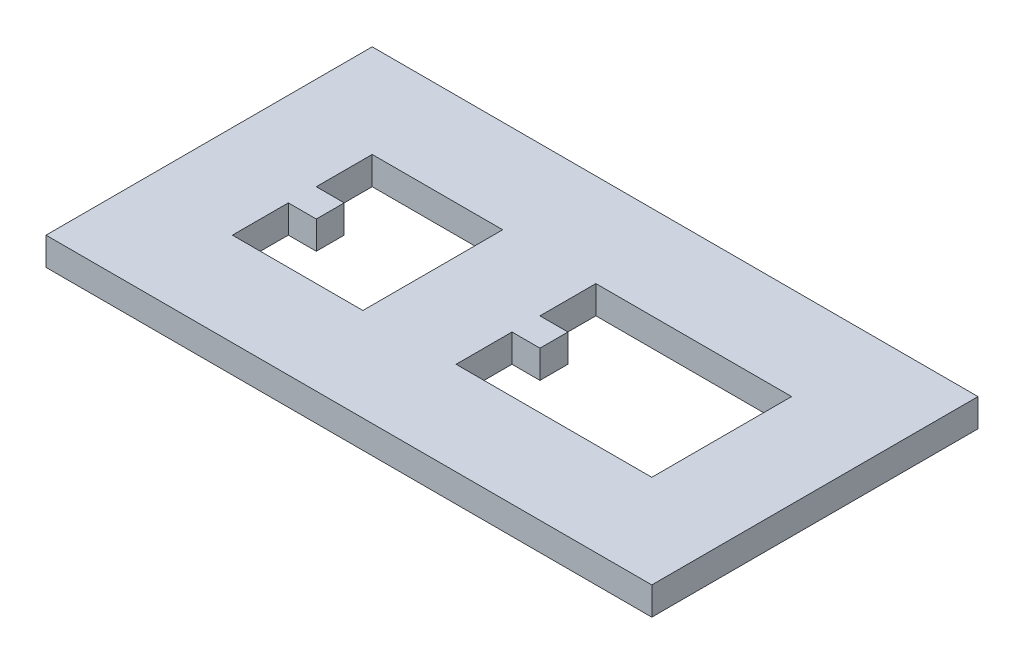
ISO-10303-21;
HEADER;
FILE_DESCRIPTION(('STEP AP214'),'2;1');
FILE_NAME('part.step','',(''),(''),'','','');
FILE_SCHEMA(('AUTOMOTIVE_DESIGN { 1 0 10303 214 1 1 1 1 }'));
ENDSEC;
DATA;
#1=APPLICATION_CONTEXT('core data for automotive mechanical design processes');
#2=APPLICATION_PROTOCOL_DEFINITION('international standard','automotive_design',2000,#1);
#3=PRODUCT_CONTEXT('',#1,'mechanical');
#4=PRODUCT('Part','Part','',(#3));
#5=PRODUCT_RELATED_PRODUCT_CATEGORY('part','',(#4));
#6=PRODUCT_DEFINITION_FORMATION('','',#4);
#7=PRODUCT_DEFINITION_CONTEXT('part definition',#1,'design');
#8=PRODUCT_DEFINITION('design','',#6,#7);
#9=PRODUCT_DEFINITION_SHAPE('','',#8);
#10=(LENGTH_UNIT() NAMED_UNIT(*) SI_UNIT(.MILLI.,.METRE.));
#11=(NAMED_UNIT(*) PLANE_ANGLE_UNIT() SI_UNIT($,.RADIAN.));
#12=(NAMED_UNIT(*) SI_UNIT($,.STERADIAN.) SOLID_ANGLE_UNIT());
#13=UNCERTAINTY_MEASURE_WITH_UNIT(LENGTH_MEASURE(1.E-05),#10,'distance_accuracy_value','');
#14=(GEOMETRIC_REPRESENTATION_CONTEXT(3) GLOBAL_UNCERTAINTY_ASSIGNED_CONTEXT((#13)) GLOBAL_UNIT_ASSIGNED_CONTEXT((#10,
#11,#12)) REPRESENTATION_CONTEXT('',''));
#15=CARTESIAN_POINT('',(0.,0.,0.));
#16=DIRECTION('',(0.,0.,1.));
#17=DIRECTION('',(1.,0.,0.));
#18=AXIS2_PLACEMENT_3D('',#15,#16,#17);
#19=CARTESIAN_POINT('',(-20.2297166911198,3.,0.));
#20=DIRECTION('',(-1.,0.,0.));
#21=DIRECTION('',(0.,0.,1.));
#22=AXIS2_PLACEMENT_3D('',#19,#20,#21);
#23=PLANE('',#22);
#24=DIRECTION('',(0.,0.,-1.));
#25=VECTOR('',#24,1.);
#26=CARTESIAN_POINT('',(-20.2297166911198,0.,0.));
#27=LINE('',#26,#25);
#28=CARTESIAN_POINT('',(-20.2297166911198,0.,-38.311583721781));
#29=VERTEX_POINT('',#28);
#30=CARTESIAN_POINT('',(-20.2297166911198,0.,-41.311583721781));
#31=VERTEX_POINT('',#30);
#32=EDGE_CURVE('E242',#29,#31,#27,.T.);
#33=ORIENTED_EDGE('',*,*,#32,.T.);
#34=DIRECTION('',(0.,-1.,0.));
#35=VECTOR('',#34,1.);
#36=CARTESIAN_POINT('',(-20.2297166911198,3.,-41.311583721781));
#37=LINE('',#36,#35);
#38=CARTESIAN_POINT('',(-20.2297166911198,3.,-41.311583721781));
#39=VERTEX_POINT('',#38);
#40=EDGE_CURVE('E11',#39,#31,#37,.T.);
#41=ORIENTED_EDGE('',*,*,#40,.F.);
#42=DIRECTION('',(0.,0.,-1.));
#43=VECTOR('',#42,1.);
#44=CARTESIAN_POINT('',(-20.2297166911198,3.,0.));
#45=LINE('',#44,#43);
#46=CARTESIAN_POINT('',(-20.2297166911198,3.,-38.311583721781));
#47=VERTEX_POINT('',#46);
#48=EDGE_CURVE('E342',#47,#39,#45,.T.);
#49=ORIENTED_EDGE('',*,*,#48,.F.);
#50=DIRECTION('',(0.,-1.,0.));
#51=VECTOR('',#50,1.);
#52=CARTESIAN_POINT('',(-20.2297166911198,3.,-38.311583721781));
#53=LINE('',#52,#51);
#54=EDGE_CURVE('E54',#47,#29,#53,.T.);
#55=ORIENTED_EDGE('',*,*,#54,.T.);
#56=EDGE_LOOP('',(#33,#41,#49,#55));
#57=FACE_BOUND('',#56,.T.);
#58=ADVANCED_FACE('F35',(#57),#23,.F.);
#59=CARTESIAN_POINT('',(0.,3.,-41.311583721781));
#60=DIRECTION('',(0.,0.,1.));
#61=DIRECTION('',(1.,0.,0.));
#62=AXIS2_PLACEMENT_3D('',#59,#60,#61);
#63=PLANE('',#62);
#64=DIRECTION('',(-1.,0.,0.));
#65=VECTOR('',#64,1.);
#66=CARTESIAN_POINT('',(0.,0.,-41.311583721781));
#67=LINE('',#66,#65);
#68=CARTESIAN_POINT('',(-23.2297166911198,0.,-41.311583721781));
#69=VERTEX_POINT('',#68);
#70=EDGE_CURVE('E244',#31,#69,#67,.T.);
#71=ORIENTED_EDGE('',*,*,#70,.T.);
#72=DIRECTION('',(0.,-1.,0.));
#73=VECTOR('',#72,1.);
#74=CARTESIAN_POINT('',(-23.2297166911198,3.,-41.311583721781));
#75=LINE('',#74,#73);
#76=CARTESIAN_POINT('',(-23.2297166911198,3.,-41.311583721781));
#77=VERTEX_POINT('',#76);
#78=EDGE_CURVE('E45',#77,#69,#75,.T.);
#79=ORIENTED_EDGE('',*,*,#78,.F.);
#80=DIRECTION('',(-1.,0.,0.));
#81=VECTOR('',#80,1.);
#82=CARTESIAN_POINT('',(0.,3.,-41.311583721781));
#83=LINE('',#82,#81);
#84=EDGE_CURVE('E344',#39,#77,#83,.T.);
#85=ORIENTED_EDGE('',*,*,#84,.F.);
#86=ORIENTED_EDGE('',*,*,#40,.T.);
#87=EDGE_LOOP('',(#71,#79,#85,#86));
#88=FACE_BOUND('',#87,.T.);
#89=ADVANCED_FACE('F369',(#88),#63,.F.);
#90=CARTESIAN_POINT('',(-23.2297166911198,3.,0.));
#91=DIRECTION('',(1.,0.,0.));
#92=DIRECTION('',(0.,0.,-1.));
#93=AXIS2_PLACEMENT_3D('',#90,#91,#92);
#94=PLANE('',#93);
#95=DIRECTION('',(0.,0.,1.));
#96=VECTOR('',#95,1.);
#97=CARTESIAN_POINT('',(-23.2297166911198,0.,0.));
#98=LINE('',#97,#96);
#99=CARTESIAN_POINT('',(-23.2297166911198,0.,-47.311583721781));
#100=VERTEX_POINT('',#99);
#101=EDGE_CURVE('E247',#100,#69,#98,.T.);
#102=ORIENTED_EDGE('',*,*,#101,.F.);
#103=DIRECTION('',(0.,-1.,0.));
#104=VECTOR('',#103,1.);
#105=CARTESIAN_POINT('',(-23.2297166911198,3.,-47.311583721781));
#106=LINE('',#105,#104);
#107=CARTESIAN_POINT('',(-23.2297166911198,3.,-47.311583721781));
#108=VERTEX_POINT('',#107);
#109=EDGE_CURVE('E269',#108,#100,#106,.T.);
#110=ORIENTED_EDGE('',*,*,#109,.F.);
#111=DIRECTION('',(0.,0.,1.));
#112=VECTOR('',#111,1.);
#113=CARTESIAN_POINT('',(-23.2297166911198,3.,0.));
#114=LINE('',#113,#112);
#115=EDGE_CURVE('E346',#108,#77,#114,.T.);
#116=ORIENTED_EDGE('',*,*,#115,.T.);
#117=ORIENTED_EDGE('',*,*,#78,.T.);
#118=EDGE_LOOP('',(#102,#110,#116,#117));
#119=FACE_BOUND('',#118,.T.);
#120=ADVANCED_FACE('F374',(#119),#94,.T.);
#121=CARTESIAN_POINT('',(0.,3.,-47.311583721781));
#122=DIRECTION('',(0.,0.,-1.));
#123=DIRECTION('',(-1.,0.,0.));
#124=AXIS2_PLACEMENT_3D('',#121,#122,#123);
#125=PLANE('',#124);
#126=DIRECTION('',(1.,0.,0.));
#127=VECTOR('',#126,1.);
#128=CARTESIAN_POINT('',(0.,0.,-47.311583721781));
#129=LINE('',#128,#127);
#130=CARTESIAN_POINT('',(-2.22971669111983,0.,-47.311583721781));
#131=VERTEX_POINT('',#130);
#132=EDGE_CURVE('E250',#100,#131,#129,.T.);
#133=ORIENTED_EDGE('',*,*,#132,.T.);
#134=DIRECTION('',(0.,-1.,0.));
#135=VECTOR('',#134,1.);
#136=CARTESIAN_POINT('',(-2.22971669111983,3.,-47.311583721781));
#137=LINE('',#136,#135);
#138=CARTESIAN_POINT('',(-2.22971669111983,3.,-47.311583721781));
#139=VERTEX_POINT('',#138);
#140=EDGE_CURVE('E267',#139,#131,#137,.T.);
#141=ORIENTED_EDGE('',*,*,#140,.F.);
#142=DIRECTION('',(1.,0.,0.));
#143=VECTOR('',#142,1.);
#144=CARTESIAN_POINT('',(0.,3.,-47.311583721781));
#145=LINE('',#144,#143);
#146=EDGE_CURVE('E349',#108,#139,#145,.T.);
#147=ORIENTED_EDGE('',*,*,#146,.F.);
#148=ORIENTED_EDGE('',*,*,#109,.T.);
#149=EDGE_LOOP('',(#133,#141,#147,#148));
#150=FACE_BOUND('',#149,.T.);
#151=ADVANCED_FACE('F462',(#150),#125,.F.);
#152=CARTESIAN_POINT('',(-2.22971669111983,3.,0.));
#153=DIRECTION('',(-1.,0.,0.));
#154=DIRECTION('',(0.,0.,1.));
#155=AXIS2_PLACEMENT_3D('',#152,#153,#154);
#156=PLANE('',#155);
#157=DIRECTION('',(0.,0.,-1.));
#158=VECTOR('',#157,1.);
#159=CARTESIAN_POINT('',(-2.22971669111983,0.,0.));
#160=LINE('',#159,#158);
#161=CARTESIAN_POINT('',(-2.22971669111983,0.,-32.311583721781));
#162=VERTEX_POINT('',#161);
#163=EDGE_CURVE('E253',#162,#131,#160,.T.);
#164=ORIENTED_EDGE('',*,*,#163,.F.);
#165=DIRECTION('',(0.,-1.,0.));
#166=VECTOR('',#165,1.);
#167=CARTESIAN_POINT('',(-2.22971669111983,3.,-32.311583721781));
#168=LINE('',#167,#166);
#169=CARTESIAN_POINT('',(-2.22971669111983,3.,-32.311583721781));
#170=VERTEX_POINT('',#169);
#171=EDGE_CURVE('E189',#170,#162,#168,.T.);
#172=ORIENTED_EDGE('',*,*,#171,.F.);
#173=DIRECTION('',(0.,0.,-1.));
#174=VECTOR('',#173,1.);
#175=CARTESIAN_POINT('',(-2.22971669111983,3.,0.));
#176=LINE('',#175,#174);
#177=EDGE_CURVE('E199',#170,#139,#176,.T.);
#178=ORIENTED_EDGE('',*,*,#177,.T.);
#179=ORIENTED_EDGE('',*,*,#140,.T.);
#180=EDGE_LOOP('',(#164,#172,#178,#179));
#181=FACE_BOUND('',#180,.T.);
#182=ADVANCED_FACE('F352',(#181),#156,.T.);
#183=CARTESIAN_POINT('',(0.,3.,-32.311583721781));
#184=DIRECTION('',(0.,0.,-1.));
#185=DIRECTION('',(-1.,0.,0.));
#186=AXIS2_PLACEMENT_3D('',#183,#184,#185);
#187=PLANE('',#186);
#188=DIRECTION('',(1.,0.,0.));
#189=VECTOR('',#188,1.);
#190=CARTESIAN_POINT('',(0.,0.,-32.311583721781));
#191=LINE('',#190,#189);
#192=CARTESIAN_POINT('',(-23.2297166911198,0.,-32.311583721781));
#193=VERTEX_POINT('',#192);
#194=EDGE_CURVE('E185',#193,#162,#191,.T.);
#195=ORIENTED_EDGE('',*,*,#194,.F.);
#196=DIRECTION('',(0.,-1.,0.));
#197=VECTOR('',#196,1.);
#198=CARTESIAN_POINT('',(-23.2297166911198,3.,-32.311583721781));
#199=LINE('',#198,#197);
#200=CARTESIAN_POINT('',(-23.2297166911198,3.,-32.311583721781));
#201=VERTEX_POINT('',#200);
#202=EDGE_CURVE('E180',#201,#193,#199,.T.);
#203=ORIENTED_EDGE('',*,*,#202,.F.);
#204=DIRECTION('',(1.,0.,0.));
#205=VECTOR('',#204,1.);
#206=CARTESIAN_POINT('',(0.,3.,-32.311583721781));
#207=LINE('',#206,#205);
#208=EDGE_CURVE('E183',#201,#170,#207,.T.);
#209=ORIENTED_EDGE('',*,*,#208,.T.);
#210=ORIENTED_EDGE('',*,*,#171,.T.);
#211=EDGE_LOOP('',(#195,#203,#209,#210));
#212=FACE_BOUND('',#211,.T.);
#213=ADVANCED_FACE('F182',(#212),#187,.T.);
#214=CARTESIAN_POINT('',(-23.2297166911198,3.,0.));
#215=DIRECTION('',(1.,0.,0.));
#216=DIRECTION('',(0.,0.,-1.));
#217=AXIS2_PLACEMENT_3D('',#214,#215,#216);
#218=PLANE('',#217);
#219=DIRECTION('',(0.,0.,1.));
#220=VECTOR('',#219,1.);
#221=CARTESIAN_POINT('',(-23.2297166911198,0.,0.));
#222=LINE('',#221,#220);
#223=CARTESIAN_POINT('',(-23.2297166911198,0.,-38.311583721781));
#224=VERTEX_POINT('',#223);
#225=EDGE_CURVE('E257',#224,#193,#222,.T.);
#226=ORIENTED_EDGE('',*,*,#225,.F.);
#227=DIRECTION('',(0.,-1.,0.));
#228=VECTOR('',#227,1.);
#229=CARTESIAN_POINT('',(-23.2297166911198,3.,-38.311583721781));
#230=LINE('',#229,#228);
#231=CARTESIAN_POINT('',(-23.2297166911198,3.,-38.311583721781));
#232=VERTEX_POINT('',#231);
#233=EDGE_CURVE('E116',#232,#224,#230,.T.);
#234=ORIENTED_EDGE('',*,*,#233,.F.);
#235=DIRECTION('',(0.,0.,1.));
#236=VECTOR('',#235,1.);
#237=CARTESIAN_POINT('',(-23.2297166911198,3.,0.));
#238=LINE('',#237,#236);
#239=EDGE_CURVE('E197',#232,#201,#238,.T.);
#240=ORIENTED_EDGE('',*,*,#239,.T.);
#241=ORIENTED_EDGE('',*,*,#202,.T.);
#242=EDGE_LOOP('',(#226,#234,#240,#241));
#243=FACE_BOUND('',#242,.T.);
#244=ADVANCED_FACE('F201',(#243),#218,.T.);
#245=CARTESIAN_POINT('',(-47.2297166911198,3.,0.));
#246=DIRECTION('',(1.,0.,0.));
#247=DIRECTION('',(0.,0.,-1.));
#248=AXIS2_PLACEMENT_3D('',#245,#246,#247);
#249=PLANE('',#248);
#250=DIRECTION('',(0.,0.,1.));
#251=VECTOR('',#250,1.);
#252=CARTESIAN_POINT('',(-47.2297166911198,0.,0.));
#253=LINE('',#252,#251);
#254=CARTESIAN_POINT('',(-47.2297166911198,0.,-38.3115837217811));
#255=VERTEX_POINT('',#254);
#256=CARTESIAN_POINT('',(-47.2297166911198,0.,-32.311583721781));
#257=VERTEX_POINT('',#256);
#258=EDGE_CURVE('E218',#255,#257,#253,.T.);
#259=ORIENTED_EDGE('',*,*,#258,.F.);
#260=DIRECTION('',(0.,-1.,0.));
#261=VECTOR('',#260,1.);
#262=CARTESIAN_POINT('',(-47.2297166911198,3.,-38.3115837217811));
#263=LINE('',#262,#261);
#264=CARTESIAN_POINT('',(-47.2297166911198,3.,-38.3115837217811));
#265=VERTEX_POINT('',#264);
#266=EDGE_CURVE('E264',#265,#255,#263,.T.);
#267=ORIENTED_EDGE('',*,*,#266,.F.);
#268=DIRECTION('',(0.,0.,1.));
#269=VECTOR('',#268,1.);
#270=CARTESIAN_POINT('',(-47.2297166911198,3.,0.));
#271=LINE('',#270,#269);
#272=CARTESIAN_POINT('',(-47.2297166911198,3.,-32.311583721781));
#273=VERTEX_POINT('',#272);
#274=EDGE_CURVE('E316',#265,#273,#271,.T.);
#275=ORIENTED_EDGE('',*,*,#274,.T.);
#276=DIRECTION('',(0.,-1.,0.));
#277=VECTOR('',#276,1.);
#278=CARTESIAN_POINT('',(-47.2297166911198,3.,-32.311583721781));
#279=LINE('',#278,#277);
#280=EDGE_CURVE('E272',#273,#257,#279,.T.);
#281=ORIENTED_EDGE('',*,*,#280,.T.);
#282=EDGE_LOOP('',(#259,#267,#275,#281));
#283=FACE_BOUND('',#282,.T.);
#284=ADVANCED_FACE('F405',(#283),#249,.T.);
#285=CARTESIAN_POINT('',(0.,3.,-38.3115837217811));
#286=DIRECTION('',(0.,0.,1.));
#287=DIRECTION('',(1.,0.,0.));
#288=AXIS2_PLACEMENT_3D('',#285,#286,#287);
#289=PLANE('',#288);
#290=DIRECTION('',(-1.,0.,0.));
#291=VECTOR('',#290,1.);
#292=CARTESIAN_POINT('',(0.,0.,-38.3115837217811));
#293=LINE('',#292,#291);
#294=CARTESIAN_POINT('',(-44.2297166911198,0.,-38.3115837217811));
#295=VERTEX_POINT('',#294);
#296=EDGE_CURVE('E221',#295,#255,#293,.T.);
#297=ORIENTED_EDGE('',*,*,#296,.F.);
#298=DIRECTION('',(0.,-1.,0.));
#299=VECTOR('',#298,1.);
#300=CARTESIAN_POINT('',(-44.2297166911198,3.,-38.3115837217811));
#301=LINE('',#300,#299);
#302=CARTESIAN_POINT('',(-44.2297166911198,3.,-38.3115837217811));
#303=VERTEX_POINT('',#302);
#304=EDGE_CURVE('E285',#303,#295,#301,.T.);
#305=ORIENTED_EDGE('',*,*,#304,.F.);
#306=DIRECTION('',(-1.,0.,0.));
#307=VECTOR('',#306,1.);
#308=CARTESIAN_POINT('',(0.,3.,-38.3115837217811));
#309=LINE('',#308,#307);
#310=EDGE_CURVE('E323',#303,#265,#309,.T.);
#311=ORIENTED_EDGE('',*,*,#310,.T.);
#312=ORIENTED_EDGE('',*,*,#266,.T.);
#313=EDGE_LOOP('',(#297,#305,#311,#312));
#314=FACE_BOUND('',#313,.T.);
#315=ADVANCED_FACE('F401',(#314),#289,.T.);
#316=CARTESIAN_POINT('',(-44.2297166911198,3.,0.));
#317=DIRECTION('',(-1.,0.,0.));
#318=DIRECTION('',(0.,0.,1.));
#319=AXIS2_PLACEMENT_3D('',#316,#317,#318);
#320=PLANE('',#319);
#321=DIRECTION('',(0.,0.,-1.));
#322=VECTOR('',#321,1.);
#323=CARTESIAN_POINT('',(-44.2297166911198,0.,0.));
#324=LINE('',#323,#322);
#325=CARTESIAN_POINT('',(-44.2297166911198,0.,-41.311583721781));
#326=VERTEX_POINT('',#325);
#327=EDGE_CURVE('E224',#295,#326,#324,.T.);
#328=ORIENTED_EDGE('',*,*,#327,.T.);
#329=DIRECTION('',(0.,-1.,0.));
#330=VECTOR('',#329,1.);
#331=CARTESIAN_POINT('',(-44.2297166911198,3.,-41.311583721781));
#332=LINE('',#331,#330);
#333=CARTESIAN_POINT('',(-44.2297166911198,3.,-41.311583721781));
#334=VERTEX_POINT('',#333);
#335=EDGE_CURVE('E282',#334,#326,#332,.T.);
#336=ORIENTED_EDGE('',*,*,#335,.F.);
#337=DIRECTION('',(0.,0.,-1.));
#338=VECTOR('',#337,1.);
#339=CARTESIAN_POINT('',(-44.2297166911198,3.,0.));
#340=LINE('',#339,#338);
#341=EDGE_CURVE('E326',#303,#334,#340,.T.);
#342=ORIENTED_EDGE('',*,*,#341,.F.);
#343=ORIENTED_EDGE('',*,*,#304,.T.);
#344=EDGE_LOOP('',(#328,#336,#342,#343));
#345=FACE_BOUND('',#344,.T.);
#346=ADVANCED_FACE('F397',(#345),#320,.F.);
#347=CARTESIAN_POINT('',(0.,3.,-41.311583721781));
#348=DIRECTION('',(0.,0.,1.));
#349=DIRECTION('',(1.,0.,0.));
#350=AXIS2_PLACEMENT_3D('',#347,#348,#349);
#351=PLANE('',#350);
#352=DIRECTION('',(-1.,0.,0.));
#353=VECTOR('',#352,1.);
#354=CARTESIAN_POINT('',(0.,0.,-41.311583721781));
#355=LINE('',#354,#353);
#356=CARTESIAN_POINT('',(-47.2297166911198,0.,-41.311583721781));
#357=VERTEX_POINT('',#356);
#358=EDGE_CURVE('E227',#326,#357,#355,.T.);
#359=ORIENTED_EDGE('',*,*,#358,.T.);
#360=DIRECTION('',(0.,-1.,0.));
#361=VECTOR('',#360,1.);
#362=CARTESIAN_POINT('',(-47.2297166911198,3.,-41.311583721781));
#363=LINE('',#362,#361);
#364=CARTESIAN_POINT('',(-47.2297166911198,3.,-41.311583721781));
#365=VERTEX_POINT('',#364);
#366=EDGE_CURVE('E280',#365,#357,#363,.T.);
#367=ORIENTED_EDGE('',*,*,#366,.F.);
#368=DIRECTION('',(-1.,0.,0.));
#369=VECTOR('',#368,1.);
#370=CARTESIAN_POINT('',(0.,3.,-41.311583721781));
#371=LINE('',#370,#369);
#372=EDGE_CURVE('E329',#334,#365,#371,.T.);
#373=ORIENTED_EDGE('',*,*,#372,.F.);
#374=ORIENTED_EDGE('',*,*,#335,.T.);
#375=EDGE_LOOP('',(#359,#367,#373,#374));
#376=FACE_BOUND('',#375,.T.);
#377=ADVANCED_FACE('F393',(#376),#351,.F.);
#378=CARTESIAN_POINT('',(-47.2297166911198,3.,0.));
#379=DIRECTION('',(1.,0.,0.));
#380=DIRECTION('',(0.,0.,-1.));
#381=AXIS2_PLACEMENT_3D('',#378,#379,#380);
#382=PLANE('',#381);
#383=DIRECTION('',(0.,0.,1.));
#384=VECTOR('',#383,1.);
#385=CARTESIAN_POINT('',(-47.2297166911198,0.,0.));
#386=LINE('',#385,#384);
#387=CARTESIAN_POINT('',(-47.2297166911198,0.,-47.311583721781));
#388=VERTEX_POINT('',#387);
#389=EDGE_CURVE('E230',#388,#357,#386,.T.);
#390=ORIENTED_EDGE('',*,*,#389,.F.);
#391=DIRECTION('',(0.,-1.,0.));
#392=VECTOR('',#391,1.);
#393=CARTESIAN_POINT('',(-47.2297166911198,3.,-47.311583721781));
#394=LINE('',#393,#392);
#395=CARTESIAN_POINT('',(-47.2297166911198,3.,-47.311583721781));
#396=VERTEX_POINT('',#395);
#397=EDGE_CURVE('E278',#396,#388,#394,.T.);
#398=ORIENTED_EDGE('',*,*,#397,.F.);
#399=DIRECTION('',(0.,0.,1.));
#400=VECTOR('',#399,1.);
#401=CARTESIAN_POINT('',(-47.2297166911198,3.,0.));
#402=LINE('',#401,#400);
#403=EDGE_CURVE('E331',#396,#365,#402,.T.);
#404=ORIENTED_EDGE('',*,*,#403,.T.);
#405=ORIENTED_EDGE('',*,*,#366,.T.);
#406=EDGE_LOOP('',(#390,#398,#404,#405));
#407=FACE_BOUND('',#406,.T.);
#408=ADVANCED_FACE('F389',(#407),#382,.T.);
#409=CARTESIAN_POINT('',(0.,3.,-47.311583721781));
#410=DIRECTION('',(0.,0.,1.));
#411=DIRECTION('',(1.,0.,0.));
#412=AXIS2_PLACEMENT_3D('',#409,#410,#411);
#413=PLANE('',#412);
#414=DIRECTION('',(-1.,0.,0.));
#415=VECTOR('',#414,1.);
#416=CARTESIAN_POINT('',(0.,0.,-47.311583721781));
#417=LINE('',#416,#415);
#418=CARTESIAN_POINT('',(-33.2297166911198,0.,-47.311583721781));
#419=VERTEX_POINT('',#418);
#420=EDGE_CURVE('E233',#419,#388,#417,.T.);
#421=ORIENTED_EDGE('',*,*,#420,.F.);
#422=DIRECTION('',(0.,-1.,0.));
#423=VECTOR('',#422,1.);
#424=CARTESIAN_POINT('',(-33.2297166911198,3.,-47.311583721781));
#425=LINE('',#424,#423);
#426=CARTESIAN_POINT('',(-33.2297166911198,3.,-47.311583721781));
#427=VERTEX_POINT('',#426);
#428=EDGE_CURVE('E276',#427,#419,#425,.T.);
#429=ORIENTED_EDGE('',*,*,#428,.F.);
#430=DIRECTION('',(-1.,0.,0.));
#431=VECTOR('',#430,1.);
#432=CARTESIAN_POINT('',(0.,3.,-47.311583721781));
#433=LINE('',#432,#431);
#434=EDGE_CURVE('E334',#427,#396,#433,.T.);
#435=ORIENTED_EDGE('',*,*,#434,.T.);
#436=ORIENTED_EDGE('',*,*,#397,.T.);
#437=EDGE_LOOP('',(#421,#429,#435,#436));
#438=FACE_BOUND('',#437,.T.);
#439=ADVANCED_FACE('F385',(#438),#413,.T.);
#440=CARTESIAN_POINT('',(-33.2297166911198,3.,0.));
#441=DIRECTION('',(-1.,0.,0.));
#442=DIRECTION('',(0.,0.,1.));
#443=AXIS2_PLACEMENT_3D('',#440,#441,#442);
#444=PLANE('',#443);
#445=DIRECTION('',(0.,0.,-1.));
#446=VECTOR('',#445,1.);
#447=CARTESIAN_POINT('',(-33.2297166911198,0.,0.));
#448=LINE('',#447,#446);
#449=CARTESIAN_POINT('',(-33.2297166911198,0.,-32.311583721781));
#450=VERTEX_POINT('',#449);
#451=EDGE_CURVE('E236',#450,#419,#448,.T.);
#452=ORIENTED_EDGE('',*,*,#451,.F.);
#453=DIRECTION('',(0.,-1.,0.));
#454=VECTOR('',#453,1.);
#455=CARTESIAN_POINT('',(-33.2297166911198,3.,-32.311583721781));
#456=LINE('',#455,#454);
#457=CARTESIAN_POINT('',(-33.2297166911198,3.,-32.311583721781));
#458=VERTEX_POINT('',#457);
#459=EDGE_CURVE('E274',#458,#450,#456,.T.);
#460=ORIENTED_EDGE('',*,*,#459,.F.);
#461=DIRECTION('',(0.,0.,-1.));
#462=VECTOR('',#461,1.);
#463=CARTESIAN_POINT('',(-33.2297166911198,3.,0.));
#464=LINE('',#463,#462);
#465=EDGE_CURVE('E337',#458,#427,#464,.T.);
#466=ORIENTED_EDGE('',*,*,#465,.T.);
#467=ORIENTED_EDGE('',*,*,#428,.T.);
#468=EDGE_LOOP('',(#452,#460,#466,#467));
#469=FACE_BOUND('',#468,.T.);
#470=ADVANCED_FACE('F382',(#469),#444,.T.);
#471=CARTESIAN_POINT('',(-57.2297166911198,3.,0.));
#472=DIRECTION('',(-1.,0.,0.));
#473=DIRECTION('',(0.,0.,1.));
#474=AXIS2_PLACEMENT_3D('',#471,#472,#473);
#475=PLANE('',#474);
#476=DIRECTION('',(0.,0.,-1.));
#477=VECTOR('',#476,1.);
#478=CARTESIAN_POINT('',(-57.2297166911198,0.,0.));
#479=LINE('',#478,#477);
#480=CARTESIAN_POINT('',(-57.2297166911199,0.,-22.3115837217811));
#481=VERTEX_POINT('',#480);
#482=CARTESIAN_POINT('',(-57.2297166911198,0.,-57.3115837217811));
#483=VERTEX_POINT('',#482);
#484=EDGE_CURVE('E208',#481,#483,#479,.T.);
#485=ORIENTED_EDGE('',*,*,#484,.F.);
#486=DIRECTION('',(0.,-1.,0.));
#487=VECTOR('',#486,1.);
#488=CARTESIAN_POINT('',(-57.2297166911199,3.,-22.3115837217811));
#489=LINE('',#488,#487);
#490=CARTESIAN_POINT('',(-57.2297166911199,3.,-22.3115837217811));
#491=VERTEX_POINT('',#490);
#492=EDGE_CURVE('E39',#491,#481,#489,.T.);
#493=ORIENTED_EDGE('',*,*,#492,.F.);
#494=DIRECTION('',(0.,0.,-1.));
#495=VECTOR('',#494,1.);
#496=CARTESIAN_POINT('',(-57.2297166911198,3.,0.));
#497=LINE('',#496,#495);
#498=CARTESIAN_POINT('',(-57.2297166911198,3.,-57.3115837217811));
#499=VERTEX_POINT('',#498);
#500=EDGE_CURVE('E262',#491,#499,#497,.T.);
#501=ORIENTED_EDGE('',*,*,#500,.T.);
#502=DIRECTION('',(0.,-1.,0.));
#503=VECTOR('',#502,1.);
#504=CARTESIAN_POINT('',(-57.2297166911198,3.,-57.3115837217811));
#505=LINE('',#504,#503);
#506=EDGE_CURVE('E204',#499,#483,#505,.T.);
#507=ORIENTED_EDGE('',*,*,#506,.T.);
#508=EDGE_LOOP('',(#485,#493,#501,#507));
#509=FACE_BOUND('',#508,.T.);
#510=ADVANCED_FACE('F37',(#509),#475,.T.);
#511=CARTESIAN_POINT('',(0.,3.,-22.311583721781));
#512=DIRECTION('',(0.,0.,-1.));
#513=DIRECTION('',(-1.,0.,0.));
#514=AXIS2_PLACEMENT_3D('',#511,#512,#513);
#515=PLANE('',#514);
#516=DIRECTION('',(1.,0.,0.));
#517=VECTOR('',#516,1.);
#518=CARTESIAN_POINT('',(0.,0.,-22.311583721781));
#519=LINE('',#518,#517);
#520=CARTESIAN_POINT('',(7.77028330888016,0.,-22.311583721781));
#521=VERTEX_POINT('',#520);
#522=EDGE_CURVE('E211',#481,#521,#519,.T.);
#523=ORIENTED_EDGE('',*,*,#522,.T.);
#524=DIRECTION('',(0.,-1.,0.));
#525=VECTOR('',#524,1.);
#526=CARTESIAN_POINT('',(7.77028330888016,3.,-22.311583721781));
#527=LINE('',#526,#525);
#528=CARTESIAN_POINT('',(7.77028330888016,3.,-22.311583721781));
#529=VERTEX_POINT('',#528);
#530=EDGE_CURVE('E291',#529,#521,#527,.T.);
#531=ORIENTED_EDGE('',*,*,#530,.F.);
#532=DIRECTION('',(1.,0.,0.));
#533=VECTOR('',#532,1.);
#534=CARTESIAN_POINT('',(0.,3.,-22.311583721781));
#535=LINE('',#534,#533);
#536=EDGE_CURVE('E300',#491,#529,#535,.T.);
#537=ORIENTED_EDGE('',*,*,#536,.F.);
#538=ORIENTED_EDGE('',*,*,#492,.T.);
#539=EDGE_LOOP('',(#523,#531,#537,#538));
#540=FACE_BOUND('',#539,.T.);
#541=ADVANCED_FACE('F299',(#540),#515,.F.);
#542=CARTESIAN_POINT('',(7.77028330888016,3.,0.));
#543=DIRECTION('',(-1.,0.,0.));
#544=DIRECTION('',(0.,0.,1.));
#545=AXIS2_PLACEMENT_3D('',#542,#543,#544);
#546=PLANE('',#545);
#547=DIRECTION('',(0.,0.,-1.));
#548=VECTOR('',#547,1.);
#549=CARTESIAN_POINT('',(7.77028330888016,0.,0.));
#550=LINE('',#549,#548);
#551=CARTESIAN_POINT('',(7.77028330888016,0.,-57.3115837217811));
#552=VERTEX_POINT('',#551);
#553=EDGE_CURVE('E213',#521,#552,#550,.T.);
#554=ORIENTED_EDGE('',*,*,#553,.T.);
#555=DIRECTION('',(0.,-1.,0.));
#556=VECTOR('',#555,1.);
#557=CARTESIAN_POINT('',(7.77028330888016,3.,-57.3115837217811));
#558=LINE('',#557,#556);
#559=CARTESIAN_POINT('',(7.77028330888016,3.,-57.3115837217811));
#560=VERTEX_POINT('',#559);
#561=EDGE_CURVE('E289',#560,#552,#558,.T.);
#562=ORIENTED_EDGE('',*,*,#561,.F.);
#563=DIRECTION('',(0.,0.,-1.));
#564=VECTOR('',#563,1.);
#565=CARTESIAN_POINT('',(7.77028330888016,3.,0.));
#566=LINE('',#565,#564);
#567=EDGE_CURVE('E313',#529,#560,#566,.T.);
#568=ORIENTED_EDGE('',*,*,#567,.F.);
#569=ORIENTED_EDGE('',*,*,#530,.T.);
#570=EDGE_LOOP('',(#554,#562,#568,#569));
#571=FACE_BOUND('',#570,.T.);
#572=ADVANCED_FACE('F312',(#571),#546,.F.);
#573=CARTESIAN_POINT('',(0.,3.,-32.311583721781));
#574=DIRECTION('',(0.,0.,1.));
#575=DIRECTION('',(1.,0.,0.));
#576=AXIS2_PLACEMENT_3D('',#573,#574,#575);
#577=PLANE('',#576);
#578=DIRECTION('',(-1.,0.,0.));
#579=VECTOR('',#578,1.);
#580=CARTESIAN_POINT('',(0.,0.,-32.311583721781));
#581=LINE('',#580,#579);
#582=EDGE_CURVE('E239',#450,#257,#581,.T.);
#583=ORIENTED_EDGE('',*,*,#582,.T.);
#584=ORIENTED_EDGE('',*,*,#280,.F.);
#585=DIRECTION('',(-1.,0.,0.));
#586=VECTOR('',#585,1.);
#587=CARTESIAN_POINT('',(0.,3.,-32.311583721781));
#588=LINE('',#587,#586);
#589=EDGE_CURVE('E340',#458,#273,#588,.T.);
#590=ORIENTED_EDGE('',*,*,#589,.F.);
#591=ORIENTED_EDGE('',*,*,#459,.T.);
#592=EDGE_LOOP('',(#583,#584,#590,#591));
#593=FACE_BOUND('',#592,.T.);
#594=ADVANCED_FACE('F364',(#593),#577,.F.);
#595=CARTESIAN_POINT('',(0.,3.,-57.311583721781));
#596=DIRECTION('',(0.,0.,1.));
#597=DIRECTION('',(1.,0.,0.));
#598=AXIS2_PLACEMENT_3D('',#595,#596,#597);
#599=PLANE('',#598);
#600=DIRECTION('',(-1.,0.,0.));
#601=VECTOR('',#600,1.);
#602=CARTESIAN_POINT('',(0.,0.,-57.311583721781));
#603=LINE('',#602,#601);
#604=EDGE_CURVE('E215',#552,#483,#603,.T.);
#605=ORIENTED_EDGE('',*,*,#604,.T.);
#606=ORIENTED_EDGE('',*,*,#506,.F.);
#607=DIRECTION('',(-1.,0.,0.));
#608=VECTOR('',#607,1.);
#609=CARTESIAN_POINT('',(0.,3.,-57.311583721781));
#610=LINE('',#609,#608);
#611=EDGE_CURVE('E311',#560,#499,#610,.T.);
#612=ORIENTED_EDGE('',*,*,#611,.F.);
#613=ORIENTED_EDGE('',*,*,#561,.T.);
#614=EDGE_LOOP('',(#605,#606,#612,#613));
#615=FACE_BOUND('',#614,.T.);
#616=ADVANCED_FACE('F309',(#615),#599,.F.);
#617=CARTESIAN_POINT('',(0.,3.,-38.311583721781));
#618=DIRECTION('',(0.,0.,1.));
#619=DIRECTION('',(1.,0.,0.));
#620=AXIS2_PLACEMENT_3D('',#617,#618,#619);
#621=PLANE('',#620);
#622=DIRECTION('',(-1.,0.,0.));
#623=VECTOR('',#622,1.);
#624=CARTESIAN_POINT('',(0.,0.,-38.311583721781));
#625=LINE('',#624,#623);
#626=EDGE_CURVE('E259',#29,#224,#625,.T.);
#627=ORIENTED_EDGE('',*,*,#626,.F.);
#628=ORIENTED_EDGE('',*,*,#54,.F.);
#629=DIRECTION('',(-1.,0.,0.));
#630=VECTOR('',#629,1.);
#631=CARTESIAN_POINT('',(0.,3.,-38.311583721781));
#632=LINE('',#631,#630);
#633=EDGE_CURVE('E202',#47,#232,#632,.T.);
#634=ORIENTED_EDGE('',*,*,#633,.T.);
#635=ORIENTED_EDGE('',*,*,#233,.T.);
#636=EDGE_LOOP('',(#627,#628,#634,#635));
#637=FACE_BOUND('',#636,.T.);
#638=ADVANCED_FACE('F356',(#637),#621,.T.);
#639=CARTESIAN_POINT('',(0.,3.,0.));
#640=DIRECTION('',(0.,1.,0.));
#641=DIRECTION('',(0.,0.,1.));
#642=AXIS2_PLACEMENT_3D('',#639,#640,#641);
#643=PLANE('',#642);
#644=ORIENTED_EDGE('',*,*,#500,.F.);
#645=ORIENTED_EDGE('',*,*,#536,.T.);
#646=ORIENTED_EDGE('',*,*,#567,.T.);
#647=ORIENTED_EDGE('',*,*,#611,.T.);
#648=EDGE_LOOP('',(#644,#645,#646,#647));
#649=FACE_BOUND('',#648,.T.);
#650=ORIENTED_EDGE('',*,*,#274,.F.);
#651=ORIENTED_EDGE('',*,*,#310,.F.);
#652=ORIENTED_EDGE('',*,*,#341,.T.);
#653=ORIENTED_EDGE('',*,*,#372,.T.);
#654=ORIENTED_EDGE('',*,*,#403,.F.);
#655=ORIENTED_EDGE('',*,*,#434,.F.);
#656=ORIENTED_EDGE('',*,*,#465,.F.);
#657=ORIENTED_EDGE('',*,*,#589,.T.);
#658=EDGE_LOOP('',(#650,#651,#652,#653,#654,#655,#656,#657));
#659=FACE_BOUND('',#658,.T.);
#660=ORIENTED_EDGE('',*,*,#48,.T.);
#661=ORIENTED_EDGE('',*,*,#84,.T.);
#662=ORIENTED_EDGE('',*,*,#115,.F.);
#663=ORIENTED_EDGE('',*,*,#146,.T.);
#664=ORIENTED_EDGE('',*,*,#177,.F.);
#665=ORIENTED_EDGE('',*,*,#208,.F.);
#666=ORIENTED_EDGE('',*,*,#239,.F.);
#667=ORIENTED_EDGE('',*,*,#633,.F.);
#668=EDGE_LOOP('',(#660,#661,#662,#663,#664,#665,#666,#667));
#669=FACE_BOUND('',#668,.T.);
#670=ADVANCED_FACE('F195',(#649,#659,#669),#643,.T.);
#671=CARTESIAN_POINT('',(0.,0.,0.));
#672=DIRECTION('',(0.,1.,0.));
#673=DIRECTION('',(0.,0.,1.));
#674=AXIS2_PLACEMENT_3D('',#671,#672,#673);
#675=PLANE('',#674);
#676=ORIENTED_EDGE('',*,*,#484,.T.);
#677=ORIENTED_EDGE('',*,*,#604,.F.);
#678=ORIENTED_EDGE('',*,*,#553,.F.);
#679=ORIENTED_EDGE('',*,*,#522,.F.);
#680=EDGE_LOOP('',(#676,#677,#678,#679));
#681=FACE_BOUND('',#680,.T.);
#682=ORIENTED_EDGE('',*,*,#258,.T.);
#683=ORIENTED_EDGE('',*,*,#582,.F.);
#684=ORIENTED_EDGE('',*,*,#451,.T.);
#685=ORIENTED_EDGE('',*,*,#420,.T.);
#686=ORIENTED_EDGE('',*,*,#389,.T.);
#687=ORIENTED_EDGE('',*,*,#358,.F.);
#688=ORIENTED_EDGE('',*,*,#327,.F.);
#689=ORIENTED_EDGE('',*,*,#296,.T.);
#690=EDGE_LOOP('',(#682,#683,#684,#685,#686,#687,#688,#689));
#691=FACE_BOUND('',#690,.T.);
#692=ORIENTED_EDGE('',*,*,#32,.F.);
#693=ORIENTED_EDGE('',*,*,#626,.T.);
#694=ORIENTED_EDGE('',*,*,#225,.T.);
#695=ORIENTED_EDGE('',*,*,#194,.T.);
#696=ORIENTED_EDGE('',*,*,#163,.T.);
#697=ORIENTED_EDGE('',*,*,#132,.F.);
#698=ORIENTED_EDGE('',*,*,#101,.T.);
#699=ORIENTED_EDGE('',*,*,#70,.F.);
#700=EDGE_LOOP('',(#692,#693,#694,#695,#696,#697,#698,#699));
#701=FACE_BOUND('',#700,.T.);
#702=ADVANCED_FACE('F303',(#681,#691,#701),#675,.F.);
#703=CLOSED_SHELL('',(#58,#89,#120,#151,#182,#213,#244,#284,#315,#346,#377,#408,#439,#470,#510,
#541,#572,#594,#616,#638,#670,#702));
#704=MANIFOLD_SOLID_BREP('B2',#703);
#705=ADVANCED_BREP_SHAPE_REPRESENTATION('',(#18,#704),#14);
#706=SHAPE_DEFINITION_REPRESENTATION(#9,#705);
ENDSEC;
END-ISO-10303-21;
